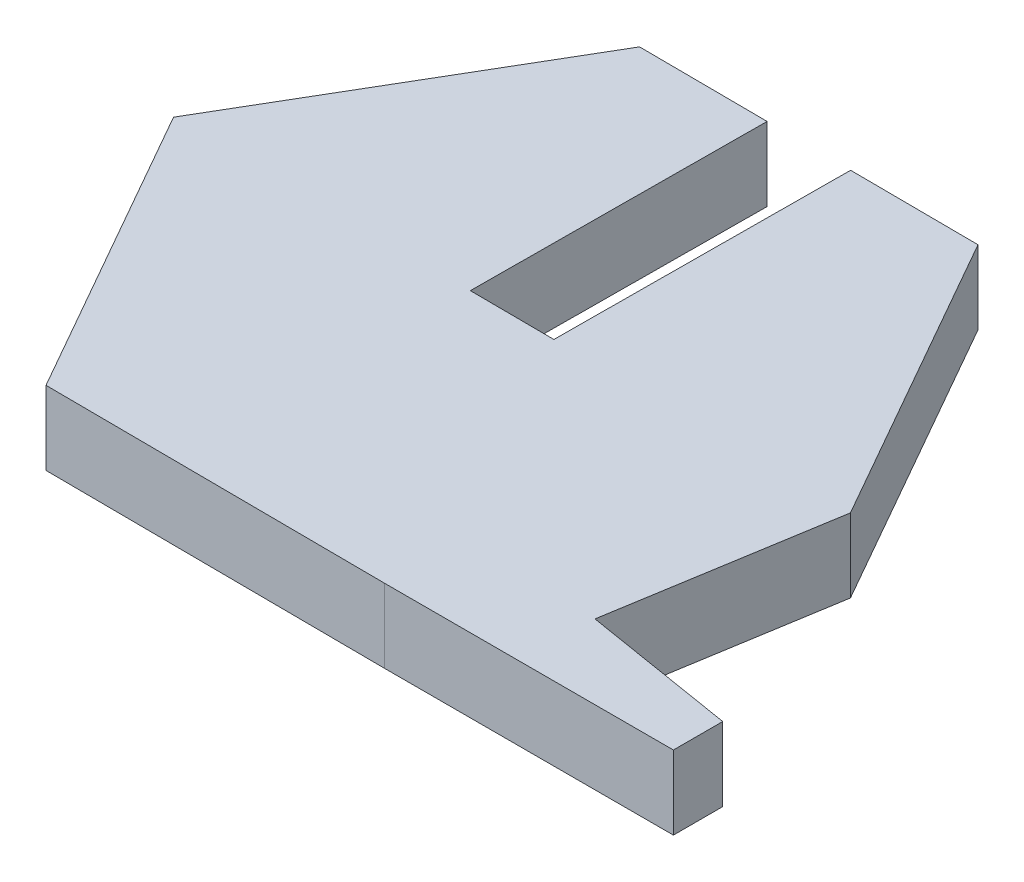
ISO-10303-21;
HEADER;
FILE_DESCRIPTION(('STEP AP214'),'2;1');
FILE_NAME('part.step','',(''),(''),'','','');
FILE_SCHEMA(('AUTOMOTIVE_DESIGN { 1 0 10303 214 1 1 1 1 }'));
ENDSEC;
DATA;
#1=APPLICATION_CONTEXT('core data for automotive mechanical design processes');
#2=APPLICATION_PROTOCOL_DEFINITION('international standard','automotive_design',2000,#1);
#3=PRODUCT_CONTEXT('',#1,'mechanical');
#4=PRODUCT('Part','Part','',(#3));
#5=PRODUCT_RELATED_PRODUCT_CATEGORY('part','',(#4));
#6=PRODUCT_DEFINITION_FORMATION('','',#4);
#7=PRODUCT_DEFINITION_CONTEXT('part definition',#1,'design');
#8=PRODUCT_DEFINITION('design','',#6,#7);
#9=PRODUCT_DEFINITION_SHAPE('','',#8);
#10=(LENGTH_UNIT() NAMED_UNIT(*) SI_UNIT(.MILLI.,.METRE.));
#11=(NAMED_UNIT(*) PLANE_ANGLE_UNIT() SI_UNIT($,.RADIAN.));
#12=(NAMED_UNIT(*) SI_UNIT($,.STERADIAN.) SOLID_ANGLE_UNIT());
#13=UNCERTAINTY_MEASURE_WITH_UNIT(LENGTH_MEASURE(1.E-05),#10,'distance_accuracy_value','');
#14=(GEOMETRIC_REPRESENTATION_CONTEXT(3) GLOBAL_UNCERTAINTY_ASSIGNED_CONTEXT((#13)) GLOBAL_UNIT_ASSIGNED_CONTEXT((#10,
#11,#12)) REPRESENTATION_CONTEXT('',''));
#15=CARTESIAN_POINT('',(0.,0.,0.));
#16=DIRECTION('',(0.,0.,1.));
#17=DIRECTION('',(1.,0.,0.));
#18=AXIS2_PLACEMENT_3D('',#15,#16,#17);
#19=CARTESIAN_POINT('',(5.83595826477384,2.5,-9.96368026710769));
#20=DIRECTION('',(-0.00625685853298923,0.,0.999980425669072));
#21=DIRECTION('',(0.999980425669072,0.,0.00625685853298923));
#22=AXIS2_PLACEMENT_3D('',#19,#20,#21);
#23=PLANE('',#22);
#24=DIRECTION('',(-0.999980425669072,0.,-0.00625685853298923));
#25=VECTOR('',#24,1.);
#26=CARTESIAN_POINT('',(5.83595826477384,2.5,-9.96368026710769));
#27=LINE('',#26,#25);
#28=CARTESIAN_POINT('',(-1.35940896365866,2.5,-10.0087015432103));
#29=VERTEX_POINT('',#28);
#30=CARTESIAN_POINT('',(-5.71082109411406,2.5,-10.0359282462737));
#31=VERTEX_POINT('',#30);
#32=EDGE_CURVE('E287',#29,#31,#27,.T.);
#33=ORIENTED_EDGE('',*,*,#32,.F.);
#34=DIRECTION('',(0.,1.,0.));
#35=VECTOR('',#34,1.);
#36=CARTESIAN_POINT('',(-1.35940896365866,2.5,-10.0087015432103));
#37=LINE('',#36,#35);
#38=CARTESIAN_POINT('',(-1.35940896365866,0.,-10.0087015432103));
#39=VERTEX_POINT('',#38);
#40=EDGE_CURVE('E253',#39,#29,#37,.T.);
#41=ORIENTED_EDGE('',*,*,#40,.F.);
#42=DIRECTION('',(-0.999980425669072,0.,-0.00625685853298923));
#43=VECTOR('',#42,1.);
#44=CARTESIAN_POINT('',(5.83595826477384,0.,-9.96368026710769));
#45=LINE('',#44,#43);
#46=CARTESIAN_POINT('',(-5.71082109411406,0.,-10.0359282462737));
#47=VERTEX_POINT('',#46);
#48=EDGE_CURVE('E171',#39,#47,#45,.T.);
#49=ORIENTED_EDGE('',*,*,#48,.T.);
#50=DIRECTION('',(0.,-1.,0.));
#51=VECTOR('',#50,1.);
#52=CARTESIAN_POINT('',(-5.71082109411406,2.5,-10.0359282462737));
#53=LINE('',#52,#51);
#54=EDGE_CURVE('E200',#31,#47,#53,.T.);
#55=ORIENTED_EDGE('',*,*,#54,.F.);
#56=EDGE_LOOP('',(#33,#41,#49,#55));
#57=FACE_BOUND('',#56,.T.);
#58=ADVANCED_FACE('F39',(#57),#23,.F.);
#59=CARTESIAN_POINT('',(10.3298675672944,2.5,7.51644835181177));
#60=DIRECTION('',(-0.161329742323625,0.,0.986900559449529));
#61=DIRECTION('',(0.986900559449529,0.,0.161329742323625));
#62=AXIS2_PLACEMENT_3D('',#59,#60,#61);
#63=PLANE('',#62);
#64=DIRECTION('',(-0.986900559449529,0.,-0.161329742323625));
#65=VECTOR('',#64,1.);
#66=CARTESIAN_POINT('',(10.3298675672944,0.,7.51644835181177));
#67=LINE('',#66,#65);
#68=CARTESIAN_POINT('',(15.5082419016361,0.,8.36296301736289));
#69=VERTEX_POINT('',#68);
#70=CARTESIAN_POINT('',(10.3298675672944,0.,7.51644835181177));
#71=VERTEX_POINT('',#70);
#72=EDGE_CURVE('E160',#69,#71,#67,.T.);
#73=ORIENTED_EDGE('',*,*,#72,.T.);
#74=DIRECTION('',(0.,-1.,0.));
#75=VECTOR('',#74,1.);
#76=CARTESIAN_POINT('',(10.3298675672944,2.5,7.51644835181177));
#77=LINE('',#76,#75);
#78=CARTESIAN_POINT('',(10.3298675672944,2.5,7.51644835181177));
#79=VERTEX_POINT('',#78);
#80=EDGE_CURVE('E11',#79,#71,#77,.T.);
#81=ORIENTED_EDGE('',*,*,#80,.F.);
#82=DIRECTION('',(-0.986900559449529,0.,-0.161329742323625));
#83=VECTOR('',#82,1.);
#84=CARTESIAN_POINT('',(10.3298675672944,2.5,7.51644835181177));
#85=LINE('',#84,#83);
#86=CARTESIAN_POINT('',(15.5082419016361,2.5,8.36296301736289));
#87=VERTEX_POINT('',#86);
#88=EDGE_CURVE('E189',#87,#79,#85,.T.);
#89=ORIENTED_EDGE('',*,*,#88,.F.);
#90=DIRECTION('',(0.,-1.,0.));
#91=VECTOR('',#90,1.);
#92=CARTESIAN_POINT('',(15.5082419016361,2.5,8.36296301736289));
#93=LINE('',#92,#91);
#94=EDGE_CURVE('E156',#87,#69,#93,.T.);
#95=ORIENTED_EDGE('',*,*,#94,.T.);
#96=EDGE_LOOP('',(#73,#81,#89,#95));
#97=FACE_BOUND('',#96,.T.);
#98=ADVANCED_FACE('F41',(#97),#63,.F.);
#99=CARTESIAN_POINT('',(11.5467793588879,2.5,0.0722479791660558));
#100=DIRECTION('',(-0.986900559449529,0.,-0.161329742323625));
#101=DIRECTION('',(-0.161329742323625,0.,0.986900559449529));
#102=AXIS2_PLACEMENT_3D('',#99,#100,#101);
#103=PLANE('',#102);
#104=DIRECTION('',(0.161329742323625,0.,-0.986900559449529));
#105=VECTOR('',#104,1.);
#106=CARTESIAN_POINT('',(11.5467793588879,0.,0.0722479791660558));
#107=LINE('',#106,#105);
#108=CARTESIAN_POINT('',(11.5467793588879,0.,0.0722479791660558));
#109=VERTEX_POINT('',#108);
#110=EDGE_CURVE('E164',#71,#109,#107,.T.);
#111=ORIENTED_EDGE('',*,*,#110,.T.);
#112=DIRECTION('',(0.,-1.,0.));
#113=VECTOR('',#112,1.);
#114=CARTESIAN_POINT('',(11.5467793588879,2.5,0.0722479791660558));
#115=LINE('',#114,#113);
#116=CARTESIAN_POINT('',(11.5467793588879,2.5,0.0722479791660558));
#117=VERTEX_POINT('',#116);
#118=EDGE_CURVE('E48',#117,#109,#115,.T.);
#119=ORIENTED_EDGE('',*,*,#118,.F.);
#120=DIRECTION('',(0.161329742323625,0.,-0.986900559449529));
#121=VECTOR('',#120,1.);
#122=CARTESIAN_POINT('',(11.5467793588879,2.5,0.0722479791660558));
#123=LINE('',#122,#121);
#124=EDGE_CURVE('E108',#79,#117,#123,.T.);
#125=ORIENTED_EDGE('',*,*,#124,.F.);
#126=ORIENTED_EDGE('',*,*,#80,.T.);
#127=EDGE_LOOP('',(#111,#119,#125,#126));
#128=FACE_BOUND('',#127,.T.);
#129=ADVANCED_FACE('F320',(#128),#103,.F.);
#130=CARTESIAN_POINT('',(11.5467793588879,2.5,0.0722479791660558));
#131=DIRECTION('',(-0.869136881183087,0.,0.494571614397082));
#132=DIRECTION('',(0.494571614397082,0.,0.869136881183087));
#133=AXIS2_PLACEMENT_3D('',#130,#131,#132);
#134=PLANE('',#133);
#135=DIRECTION('',(-0.494571614397082,0.,-0.869136881183087));
#136=VECTOR('',#135,1.);
#137=CARTESIAN_POINT('',(11.5467793588879,0.,0.0722479791660558));
#138=LINE('',#137,#136);
#139=CARTESIAN_POINT('',(5.83595826477384,0.,-9.96368026710769));
#140=VERTEX_POINT('',#139);
#141=EDGE_CURVE('E168',#109,#140,#138,.T.);
#142=ORIENTED_EDGE('',*,*,#141,.T.);
#143=DIRECTION('',(0.,-1.,0.));
#144=VECTOR('',#143,1.);
#145=CARTESIAN_POINT('',(5.83595826477384,2.5,-9.96368026710769));
#146=LINE('',#145,#144);
#147=CARTESIAN_POINT('',(5.83595826477384,2.5,-9.96368026710769));
#148=VERTEX_POINT('',#147);
#149=EDGE_CURVE('E204',#148,#140,#146,.T.);
#150=ORIENTED_EDGE('',*,*,#149,.F.);
#151=DIRECTION('',(-0.494571614397082,0.,-0.869136881183087));
#152=VECTOR('',#151,1.);
#153=CARTESIAN_POINT('',(11.5467793588879,2.5,0.0722479791660558));
#154=LINE('',#153,#152);
#155=EDGE_CURVE('E214',#117,#148,#154,.T.);
#156=ORIENTED_EDGE('',*,*,#155,.F.);
#157=ORIENTED_EDGE('',*,*,#118,.T.);
#158=EDGE_LOOP('',(#142,#150,#156,#157));
#159=FACE_BOUND('',#158,.T.);
#160=ADVANCED_FACE('F212',(#159),#134,.F.);
#161=CARTESIAN_POINT('',(1.4905352494982,0.,-9.99086949639124));
#162=VERTEX_POINT('',#161);
#163=EDGE_CURVE('E172',#140,#162,#45,.T.);
#164=ORIENTED_EDGE('',*,*,#163,.T.);
#165=DIRECTION('',(0.,-1.,0.));
#166=VECTOR('',#165,1.);
#167=CARTESIAN_POINT('',(1.4905352494982,2.5,-9.99086949639124));
#168=LINE('',#167,#166);
#169=CARTESIAN_POINT('',(1.4905352494982,2.5,-9.99086949639124));
#170=VERTEX_POINT('',#169);
#171=EDGE_CURVE('E230',#170,#162,#168,.T.);
#172=ORIENTED_EDGE('',*,*,#171,.F.);
#173=EDGE_CURVE('E288',#148,#170,#27,.T.);
#174=ORIENTED_EDGE('',*,*,#173,.F.);
#175=ORIENTED_EDGE('',*,*,#149,.T.);
#176=EDGE_LOOP('',(#164,#172,#174,#175));
#177=FACE_BOUND('',#176,.T.);
#178=ADVANCED_FACE('F226',(#177),#23,.F.);
#179=CARTESIAN_POINT('',(-5.71082109411406,2.5,-10.0359282462737));
#180=DIRECTION('',(0.862880022650098,0.,0.50540881127199));
#181=DIRECTION('',(0.50540881127199,0.,-0.862880022650098));
#182=AXIS2_PLACEMENT_3D('',#179,#180,#181);
#183=PLANE('',#182);
#184=DIRECTION('',(-0.50540881127199,0.,0.862880022650098));
#185=VECTOR('',#184,1.);
#186=CARTESIAN_POINT('',(-5.71082109411406,0.,-10.0359282462737));
#187=LINE('',#186,#185);
#188=CARTESIAN_POINT('',(-11.5467793588879,0.,-0.0722479791660576));
#189=VERTEX_POINT('',#188);
#190=EDGE_CURVE('E176',#47,#189,#187,.T.);
#191=ORIENTED_EDGE('',*,*,#190,.T.);
#192=DIRECTION('',(0.,-1.,0.));
#193=VECTOR('',#192,1.);
#194=CARTESIAN_POINT('',(-11.5467793588879,2.5,-0.0722479791660576));
#195=LINE('',#194,#193);
#196=CARTESIAN_POINT('',(-11.5467793588879,2.5,-0.0722479791660576));
#197=VERTEX_POINT('',#196);
#198=EDGE_CURVE('E196',#197,#189,#195,.T.);
#199=ORIENTED_EDGE('',*,*,#198,.F.);
#200=DIRECTION('',(-0.50540881127199,0.,0.862880022650098));
#201=VECTOR('',#200,1.);
#202=CARTESIAN_POINT('',(-5.71082109411406,2.5,-10.0359282462737));
#203=LINE('',#202,#201);
#204=EDGE_CURVE('E291',#31,#197,#203,.T.);
#205=ORIENTED_EDGE('',*,*,#204,.F.);
#206=ORIENTED_EDGE('',*,*,#54,.T.);
#207=EDGE_LOOP('',(#191,#199,#205,#206));
#208=FACE_BOUND('',#207,.T.);
#209=ADVANCED_FACE('F302',(#208),#183,.F.);
#210=CARTESIAN_POINT('',(-11.5467793588879,2.5,-0.0722479791660576));
#211=DIRECTION('',(0.869136881183088,0.,-0.494571614397082));
#212=DIRECTION('',(-0.494571614397082,0.,-0.869136881183088));
#213=AXIS2_PLACEMENT_3D('',#210,#211,#212);
#214=PLANE('',#213);
#215=DIRECTION('',(0.494571614397082,0.,0.869136881183088));
#216=VECTOR('',#215,1.);
#217=CARTESIAN_POINT('',(-11.5467793588879,0.,-0.0722479791660576));
#218=LINE('',#217,#216);
#219=CARTESIAN_POINT('',(-5.83595826477384,0.,9.96368026710769));
#220=VERTEX_POINT('',#219);
#221=EDGE_CURVE('E179',#189,#220,#218,.T.);
#222=ORIENTED_EDGE('',*,*,#221,.T.);
#223=DIRECTION('',(0.,-1.,0.));
#224=VECTOR('',#223,1.);
#225=CARTESIAN_POINT('',(-5.83595826477384,2.5,9.96368026710769));
#226=LINE('',#225,#224);
#227=CARTESIAN_POINT('',(-5.83595826477384,2.5,9.96368026710769));
#228=VERTEX_POINT('',#227);
#229=EDGE_CURVE('E149',#228,#220,#226,.T.);
#230=ORIENTED_EDGE('',*,*,#229,.F.);
#231=DIRECTION('',(0.494571614397082,0.,0.869136881183088));
#232=VECTOR('',#231,1.);
#233=CARTESIAN_POINT('',(-11.5467793588879,2.5,-0.0722479791660576));
#234=LINE('',#233,#232);
#235=EDGE_CURVE('E135',#197,#228,#234,.T.);
#236=ORIENTED_EDGE('',*,*,#235,.F.);
#237=ORIENTED_EDGE('',*,*,#198,.T.);
#238=EDGE_LOOP('',(#222,#230,#236,#237));
#239=FACE_BOUND('',#238,.T.);
#240=ADVANCED_FACE('F306',(#239),#214,.F.);
#241=CARTESIAN_POINT('',(-5.83595826477384,2.5,9.96368026710769));
#242=DIRECTION('',(0.00625685853298938,0.,-0.999980425669072));
#243=DIRECTION('',(-0.999980425669072,0.,-0.00625685853298938));
#244=AXIS2_PLACEMENT_3D('',#241,#242,#243);
#245=PLANE('',#244);
#246=DIRECTION('',(0.999980425669072,0.,0.00625685853298938));
#247=VECTOR('',#246,1.);
#248=CARTESIAN_POINT('',(-5.83595826477384,0.,9.96368026710769));
#249=LINE('',#248,#247);
#250=CARTESIAN_POINT('',(5.71082109411406,0.,10.0359282462737));
#251=VERTEX_POINT('',#250);
#252=EDGE_CURVE('E145',#220,#251,#249,.T.);
#253=ORIENTED_EDGE('',*,*,#252,.T.);
#254=DIRECTION('',(0.,-1.,0.));
#255=VECTOR('',#254,1.);
#256=CARTESIAN_POINT('',(5.71082109411406,2.5,10.0359282462737));
#257=LINE('',#256,#255);
#258=CARTESIAN_POINT('',(5.71082109411406,2.5,10.0359282462737));
#259=VERTEX_POINT('',#258);
#260=EDGE_CURVE('E142',#259,#251,#257,.T.);
#261=ORIENTED_EDGE('',*,*,#260,.F.);
#262=DIRECTION('',(0.999980425669072,0.,0.00625685853298938));
#263=VECTOR('',#262,1.);
#264=CARTESIAN_POINT('',(-5.83595826477384,2.5,9.96368026710769));
#265=LINE('',#264,#263);
#266=EDGE_CURVE('E127',#228,#259,#265,.T.);
#267=ORIENTED_EDGE('',*,*,#266,.F.);
#268=ORIENTED_EDGE('',*,*,#229,.T.);
#269=EDGE_LOOP('',(#253,#261,#267,#268));
#270=FACE_BOUND('',#269,.T.);
#271=ADVANCED_FACE('F143',(#270),#245,.F.);
#272=CARTESIAN_POINT('',(15.5082419016361,2.5,10.0359282462737));
#273=DIRECTION('',(0.,0.,-1.));
#274=DIRECTION('',(-1.,0.,0.));
#275=AXIS2_PLACEMENT_3D('',#272,#273,#274);
#276=PLANE('',#275);
#277=DIRECTION('',(1.,0.,0.));
#278=VECTOR('',#277,1.);
#279=CARTESIAN_POINT('',(15.5082419016361,0.,10.0359282462737));
#280=LINE('',#279,#278);
#281=CARTESIAN_POINT('',(15.5082419016361,0.,10.0359282462737));
#282=VERTEX_POINT('',#281);
#283=EDGE_CURVE('E184',#251,#282,#280,.T.);
#284=ORIENTED_EDGE('',*,*,#283,.T.);
#285=DIRECTION('',(0.,-1.,0.));
#286=VECTOR('',#285,1.);
#287=CARTESIAN_POINT('',(15.5082419016361,2.5,10.0359282462737));
#288=LINE('',#287,#286);
#289=CARTESIAN_POINT('',(15.5082419016361,2.5,10.0359282462737));
#290=VERTEX_POINT('',#289);
#291=EDGE_CURVE('E150',#290,#282,#288,.T.);
#292=ORIENTED_EDGE('',*,*,#291,.F.);
#293=DIRECTION('',(1.,0.,0.));
#294=VECTOR('',#293,1.);
#295=CARTESIAN_POINT('',(15.5082419016361,2.5,10.0359282462737));
#296=LINE('',#295,#294);
#297=EDGE_CURVE('E132',#259,#290,#296,.T.);
#298=ORIENTED_EDGE('',*,*,#297,.F.);
#299=ORIENTED_EDGE('',*,*,#260,.T.);
#300=EDGE_LOOP('',(#284,#292,#298,#299));
#301=FACE_BOUND('',#300,.T.);
#302=ADVANCED_FACE('F152',(#301),#276,.F.);
#303=CARTESIAN_POINT('',(15.5082419016361,2.5,8.36296301736289));
#304=DIRECTION('',(-1.,0.,0.));
#305=DIRECTION('',(0.,0.,1.));
#306=AXIS2_PLACEMENT_3D('',#303,#304,#305);
#307=PLANE('',#306);
#308=DIRECTION('',(0.,0.,-1.));
#309=VECTOR('',#308,1.);
#310=CARTESIAN_POINT('',(15.5082419016361,0.,8.36296301736289));
#311=LINE('',#310,#309);
#312=EDGE_CURVE('E100',#282,#69,#311,.T.);
#313=ORIENTED_EDGE('',*,*,#312,.T.);
#314=ORIENTED_EDGE('',*,*,#94,.F.);
#315=DIRECTION('',(0.,0.,-1.));
#316=VECTOR('',#315,1.);
#317=CARTESIAN_POINT('',(15.5082419016361,2.5,8.36296301736289));
#318=LINE('',#317,#316);
#319=EDGE_CURVE('E64',#290,#87,#318,.T.);
#320=ORIENTED_EDGE('',*,*,#319,.F.);
#321=ORIENTED_EDGE('',*,*,#291,.T.);
#322=EDGE_LOOP('',(#313,#314,#320,#321));
#323=FACE_BOUND('',#322,.T.);
#324=ADVANCED_FACE('F334',(#323),#307,.F.);
#325=CARTESIAN_POINT('',(0.,2.5,0.));
#326=DIRECTION('',(0.,-1.,0.));
#327=DIRECTION('',(0.,0.,-1.));
#328=AXIS2_PLACEMENT_3D('',#325,#326,#327);
#329=PLANE('',#328);
#330=DIRECTION('',(0.999980425669072,0.,0.00625685853298878));
#331=VECTOR('',#330,1.);
#332=CARTESIAN_POINT('',(-1.42197754898855,2.5,-0.00889728651953629));
#333=LINE('',#332,#331);
#334=CARTESIAN_POINT('',(-1.42197754898855,2.5,-0.00889728651953629));
#335=VERTEX_POINT('',#334);
#336=CARTESIAN_POINT('',(1.4279666641683,2.5,0.00893476029948173));
#337=VERTEX_POINT('',#336);
#338=EDGE_CURVE('E260',#335,#337,#333,.T.);
#339=ORIENTED_EDGE('',*,*,#338,.F.);
#340=DIRECTION('',(0.00625685853298924,0.,-0.999980425669072));
#341=VECTOR('',#340,1.);
#342=CARTESIAN_POINT('',(-1.42197754898855,2.5,-0.00889728651953629));
#343=LINE('',#342,#341);
#344=EDGE_CURVE('E248',#335,#29,#343,.T.);
#345=ORIENTED_EDGE('',*,*,#344,.T.);
#346=ORIENTED_EDGE('',*,*,#32,.T.);
#347=ORIENTED_EDGE('',*,*,#204,.T.);
#348=ORIENTED_EDGE('',*,*,#235,.T.);
#349=ORIENTED_EDGE('',*,*,#266,.T.);
#350=ORIENTED_EDGE('',*,*,#297,.T.);
#351=ORIENTED_EDGE('',*,*,#319,.T.);
#352=ORIENTED_EDGE('',*,*,#88,.T.);
#353=ORIENTED_EDGE('',*,*,#124,.T.);
#354=ORIENTED_EDGE('',*,*,#155,.T.);
#355=ORIENTED_EDGE('',*,*,#173,.T.);
#356=DIRECTION('',(0.00625685853298924,0.,-0.999980425669072));
#357=VECTOR('',#356,1.);
#358=CARTESIAN_POINT('',(1.4279666641683,2.5,0.00893476029948173));
#359=LINE('',#358,#357);
#360=EDGE_CURVE('E256',#337,#170,#359,.T.);
#361=ORIENTED_EDGE('',*,*,#360,.F.);
#362=EDGE_LOOP('',(#339,#345,#346,#347,#348,#349,#350,#351,#352,#353,#354,#355,#361));
#363=FACE_BOUND('',#362,.T.);
#364=ADVANCED_FACE('F130',(#363),#329,.F.);
#365=CARTESIAN_POINT('',(0.,0.,0.));
#366=DIRECTION('',(0.,-1.,0.));
#367=DIRECTION('',(0.,0.,-1.));
#368=AXIS2_PLACEMENT_3D('',#365,#366,#367);
#369=PLANE('',#368);
#370=DIRECTION('',(0.00625685853298924,0.,-0.999980425669072));
#371=VECTOR('',#370,1.);
#372=CARTESIAN_POINT('',(-1.42197754898855,0.,-0.00889728651953629));
#373=LINE('',#372,#371);
#374=CARTESIAN_POINT('',(-1.42197754898855,0.,-0.00889728651953629));
#375=VERTEX_POINT('',#374);
#376=EDGE_CURVE('E165',#375,#39,#373,.T.);
#377=ORIENTED_EDGE('',*,*,#376,.F.);
#378=DIRECTION('',(-0.999980425669072,0.,-0.00625685853298878));
#379=VECTOR('',#378,1.);
#380=CARTESIAN_POINT('',(-1.42197754898855,0.,-0.00889728651953629));
#381=LINE('',#380,#379);
#382=CARTESIAN_POINT('',(1.4279666641683,0.,0.00893476029947987));
#383=VERTEX_POINT('',#382);
#384=EDGE_CURVE('E257',#383,#375,#381,.T.);
#385=ORIENTED_EDGE('',*,*,#384,.F.);
#386=DIRECTION('',(0.00625685853298924,0.,-0.999980425669072));
#387=VECTOR('',#386,1.);
#388=CARTESIAN_POINT('',(1.4279666641683,0.,0.00893476029948173));
#389=LINE('',#388,#387);
#390=EDGE_CURVE('E223',#383,#162,#389,.T.);
#391=ORIENTED_EDGE('',*,*,#390,.T.);
#392=ORIENTED_EDGE('',*,*,#163,.F.);
#393=ORIENTED_EDGE('',*,*,#141,.F.);
#394=ORIENTED_EDGE('',*,*,#110,.F.);
#395=ORIENTED_EDGE('',*,*,#72,.F.);
#396=ORIENTED_EDGE('',*,*,#312,.F.);
#397=ORIENTED_EDGE('',*,*,#283,.F.);
#398=ORIENTED_EDGE('',*,*,#252,.F.);
#399=ORIENTED_EDGE('',*,*,#221,.F.);
#400=ORIENTED_EDGE('',*,*,#190,.F.);
#401=ORIENTED_EDGE('',*,*,#48,.F.);
#402=EDGE_LOOP('',(#377,#385,#391,#392,#393,#394,#395,#396,#397,#398,#399,#400,#401));
#403=FACE_BOUND('',#402,.T.);
#404=ADVANCED_FACE('F218',(#403),#369,.T.);
#405=CARTESIAN_POINT('',(-1.42197754898855,2.5,-0.00889728651953629));
#406=DIRECTION('',(-0.999980425669072,0.,-0.00625685853298924));
#407=DIRECTION('',(-0.00625685853298924,0.,0.999980425669072));
#408=AXIS2_PLACEMENT_3D('',#405,#406,#407);
#409=PLANE('',#408);
#410=ORIENTED_EDGE('',*,*,#40,.T.);
#411=ORIENTED_EDGE('',*,*,#344,.F.);
#412=DIRECTION('',(0.,1.,0.));
#413=VECTOR('',#412,1.);
#414=CARTESIAN_POINT('',(-1.42197754898855,2.5,-0.00889728651953629));
#415=LINE('',#414,#413);
#416=EDGE_CURVE('E251',#375,#335,#415,.T.);
#417=ORIENTED_EDGE('',*,*,#416,.F.);
#418=ORIENTED_EDGE('',*,*,#376,.T.);
#419=EDGE_LOOP('',(#410,#411,#417,#418));
#420=FACE_BOUND('',#419,.T.);
#421=ADVANCED_FACE('F250',(#420),#409,.F.);
#422=CARTESIAN_POINT('',(1.4279666641683,2.5,0.00893476029948173));
#423=DIRECTION('',(0.999980425669072,0.,0.00625685853298924));
#424=DIRECTION('',(0.00625685853298924,0.,-0.999980425669072));
#425=AXIS2_PLACEMENT_3D('',#422,#423,#424);
#426=PLANE('',#425);
#427=ORIENTED_EDGE('',*,*,#171,.T.);
#428=ORIENTED_EDGE('',*,*,#390,.F.);
#429=DIRECTION('',(0.,-1.,0.));
#430=VECTOR('',#429,1.);
#431=CARTESIAN_POINT('',(1.4279666641683,2.5,0.00893476029948173));
#432=LINE('',#431,#430);
#433=EDGE_CURVE('E55',#337,#383,#432,.T.);
#434=ORIENTED_EDGE('',*,*,#433,.F.);
#435=ORIENTED_EDGE('',*,*,#360,.T.);
#436=EDGE_LOOP('',(#427,#428,#434,#435));
#437=FACE_BOUND('',#436,.T.);
#438=ADVANCED_FACE('F348',(#437),#426,.F.);
#439=CARTESIAN_POINT('',(0.,0.,0.));
#440=DIRECTION('',(-0.00625685853298878,0.,0.999980425669072));
#441=DIRECTION('',(0.999980425669072,0.,0.00625685853298878));
#442=AXIS2_PLACEMENT_3D('',#439,#440,#441);
#443=PLANE('',#442);
#444=ORIENTED_EDGE('',*,*,#416,.T.);
#445=ORIENTED_EDGE('',*,*,#338,.T.);
#446=ORIENTED_EDGE('',*,*,#433,.T.);
#447=ORIENTED_EDGE('',*,*,#384,.T.);
#448=EDGE_LOOP('',(#444,#445,#446,#447));
#449=FACE_BOUND('',#448,.T.);
#450=ADVANCED_FACE('F259',(#449),#443,.F.);
#451=CLOSED_SHELL('',(#58,#98,#129,#160,#178,#209,#240,#271,#302,#324,#364,#404,#421,#438,#450));
#452=MANIFOLD_SOLID_BREP('B2',#451);
#453=ADVANCED_BREP_SHAPE_REPRESENTATION('',(#18,#452),#14);
#454=SHAPE_DEFINITION_REPRESENTATION(#9,#453);
ENDSEC;
END-ISO-10303-21;
